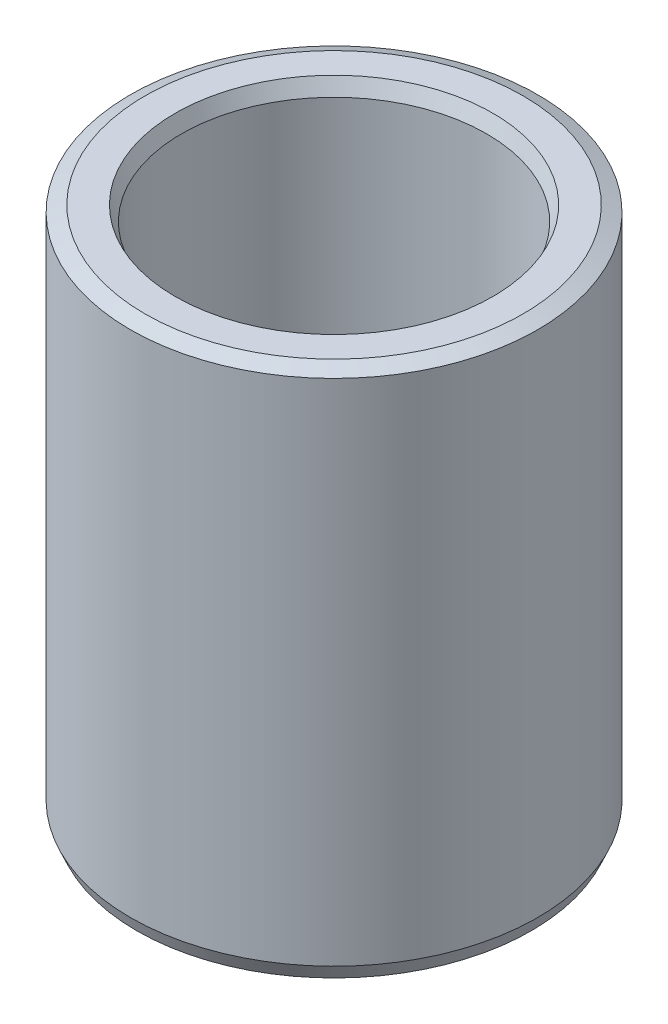
ISO-10303-21;
HEADER;
FILE_DESCRIPTION(('STEP AP214'),'2;1');
FILE_NAME('part.step','',(''),(''),'','','');
FILE_SCHEMA(('AUTOMOTIVE_DESIGN { 1 0 10303 214 1 1 1 1 }'));
ENDSEC;
DATA;
#1=APPLICATION_CONTEXT('core data for automotive mechanical design processes');
#2=APPLICATION_PROTOCOL_DEFINITION('international standard','automotive_design',2000,#1);
#3=PRODUCT_CONTEXT('',#1,'mechanical');
#4=PRODUCT('Part','Part','',(#3));
#5=PRODUCT_RELATED_PRODUCT_CATEGORY('part','',(#4));
#6=PRODUCT_DEFINITION_FORMATION('','',#4);
#7=PRODUCT_DEFINITION_CONTEXT('part definition',#1,'design');
#8=PRODUCT_DEFINITION('design','',#6,#7);
#9=PRODUCT_DEFINITION_SHAPE('','',#8);
#10=(LENGTH_UNIT() NAMED_UNIT(*) SI_UNIT(.MILLI.,.METRE.));
#11=(NAMED_UNIT(*) PLANE_ANGLE_UNIT() SI_UNIT($,.RADIAN.));
#12=(NAMED_UNIT(*) SI_UNIT($,.STERADIAN.) SOLID_ANGLE_UNIT());
#13=UNCERTAINTY_MEASURE_WITH_UNIT(LENGTH_MEASURE(1.E-05),#10,'distance_accuracy_value','');
#14=(GEOMETRIC_REPRESENTATION_CONTEXT(3) GLOBAL_UNCERTAINTY_ASSIGNED_CONTEXT((#13)) GLOBAL_UNIT_ASSIGNED_CONTEXT((#10,
#11,#12)) REPRESENTATION_CONTEXT('',''));
#15=CARTESIAN_POINT('',(0.,0.,0.));
#16=DIRECTION('',(0.,0.,1.));
#17=DIRECTION('',(1.,0.,0.));
#18=AXIS2_PLACEMENT_3D('',#15,#16,#17);
#19=CARTESIAN_POINT('',(0.,91.1093679499798,0.));
#20=DIRECTION('',(0.,-1.,0.));
#21=DIRECTION('',(0.,0.,-1.));
#22=AXIS2_PLACEMENT_3D('',#19,#20,#21);
#23=CYLINDRICAL_SURFACE('',#22,35.);
#24=CARTESIAN_POINT('',(0.,2.51631455846664,0.));
#25=DIRECTION('',(0.,1.,0.));
#26=DIRECTION('',(0.,0.,1.));
#27=AXIS2_PLACEMENT_3D('',#24,#25,#26);
#28=CIRCLE('',#27,35.);
#29=CARTESIAN_POINT('',(0.,2.51631455846664,35.));
#30=VERTEX_POINT('',#29);
#31=EDGE_CURVE('E10',#30,#30,#28,.T.);
#32=ORIENTED_EDGE('',*,*,#31,.T.);
#33=EDGE_LOOP('',(#32));
#34=FACE_BOUND('',#33,.T.);
#35=CARTESIAN_POINT('',(0.,90.0208981511356,0.));
#36=DIRECTION('',(0.,1.,0.));
#37=DIRECTION('',(0.,0.,1.));
#38=AXIS2_PLACEMENT_3D('',#35,#36,#37);
#39=CIRCLE('',#38,35.);
#40=CARTESIAN_POINT('',(0.,90.0208981511356,35.));
#41=VERTEX_POINT('',#40);
#42=EDGE_CURVE('E50',#41,#41,#39,.F.);
#43=ORIENTED_EDGE('',*,*,#42,.T.);
#44=EDGE_LOOP('',(#43));
#45=FACE_BOUND('',#44,.T.);
#46=ADVANCED_FACE('F39',(#34,#45),#23,.T.);
#47=CARTESIAN_POINT('',(0.,91.1093679499798,0.));
#48=DIRECTION('',(0.,1.,0.));
#49=DIRECTION('',(0.,0.,1.));
#50=AXIS2_PLACEMENT_3D('',#47,#48,#49);
#51=PLANE('',#50);
#52=CARTESIAN_POINT('',(0.,91.1093679499798,0.));
#53=DIRECTION('',(0.,1.,0.));
#54=DIRECTION('',(0.,0.,1.));
#55=AXIS2_PLACEMENT_3D('',#52,#53,#54);
#56=CIRCLE('',#55,27.3035944813365);
#57=CARTESIAN_POINT('',(0.,91.1093679499798,27.3035944813365));
#58=VERTEX_POINT('',#57);
#59=EDGE_CURVE('E58',#58,#58,#56,.F.);
#60=ORIENTED_EDGE('',*,*,#59,.T.);
#61=EDGE_LOOP('',(#60));
#62=FACE_BOUND('',#61,.T.);
#63=CARTESIAN_POINT('',(0.,91.1093679499798,0.));
#64=DIRECTION('',(0.,1.,0.));
#65=DIRECTION('',(0.,0.,1.));
#66=AXIS2_PLACEMENT_3D('',#63,#64,#65);
#67=CIRCLE('',#66,32.4836854415334);
#68=CARTESIAN_POINT('',(0.,91.1093679499798,32.4836854415334));
#69=VERTEX_POINT('',#68);
#70=EDGE_CURVE('E61',#69,#69,#67,.T.);
#71=ORIENTED_EDGE('',*,*,#70,.T.);
#72=EDGE_LOOP('',(#71));
#73=FACE_BOUND('',#72,.T.);
#74=ADVANCED_FACE('F88',(#62,#73),#51,.T.);
#75=CARTESIAN_POINT('',(0.,0.,0.));
#76=DIRECTION('',(0.,1.,0.));
#77=DIRECTION('',(0.,0.,1.));
#78=AXIS2_PLACEMENT_3D('',#75,#76,#77);
#79=PLANE('',#78);
#80=CARTESIAN_POINT('',(0.,0.,0.));
#81=DIRECTION('',(0.,1.,0.));
#82=DIRECTION('',(0.,0.,1.));
#83=AXIS2_PLACEMENT_3D('',#80,#81,#82);
#84=CIRCLE('',#83,28.7314392409589);
#85=CARTESIAN_POINT('',(0.,0.,28.7314392409589));
#86=VERTEX_POINT('',#85);
#87=EDGE_CURVE('E51',#86,#86,#84,.T.);
#88=ORIENTED_EDGE('',*,*,#87,.T.);
#89=EDGE_LOOP('',(#88));
#90=FACE_BOUND('',#89,.T.);
#91=CARTESIAN_POINT('',(0.,0.,0.));
#92=DIRECTION('',(0.,1.,0.));
#93=DIRECTION('',(0.,0.,1.));
#94=AXIS2_PLACEMENT_3D('',#91,#92,#93);
#95=CIRCLE('',#94,33.9115302011558);
#96=CARTESIAN_POINT('',(0.,0.,33.9115302011558));
#97=VERTEX_POINT('',#96);
#98=EDGE_CURVE('E54',#97,#97,#95,.F.);
#99=ORIENTED_EDGE('',*,*,#98,.T.);
#100=EDGE_LOOP('',(#99));
#101=FACE_BOUND('',#100,.T.);
#102=ADVANCED_FACE('F83',(#90,#101),#79,.F.);
#103=CARTESIAN_POINT('',(0.,91.1093679499798,0.));
#104=DIRECTION('',(0.,-1.,0.));
#105=DIRECTION('',(0.,0.,-1.));
#106=AXIS2_PLACEMENT_3D('',#103,#104,#105);
#107=CYLINDRICAL_SURFACE('',#106,26.2151246824923);
#108=CARTESIAN_POINT('',(0.,88.5930533915131,0.));
#109=DIRECTION('',(0.,1.,0.));
#110=DIRECTION('',(0.,0.,1.));
#111=AXIS2_PLACEMENT_3D('',#108,#109,#110);
#112=CIRCLE('',#111,26.2151246824923);
#113=CARTESIAN_POINT('',(0.,88.5930533915131,26.2151246824923));
#114=VERTEX_POINT('',#113);
#115=EDGE_CURVE('E67',#114,#114,#112,.T.);
#116=ORIENTED_EDGE('',*,*,#115,.T.);
#117=EDGE_LOOP('',(#116));
#118=FACE_BOUND('',#117,.T.);
#119=CARTESIAN_POINT('',(0.,1.08846979884418,0.));
#120=DIRECTION('',(0.,1.,0.));
#121=DIRECTION('',(0.,0.,1.));
#122=AXIS2_PLACEMENT_3D('',#119,#120,#121);
#123=CIRCLE('',#122,26.2151246824923);
#124=CARTESIAN_POINT('',(0.,1.08846979884418,26.2151246824923));
#125=VERTEX_POINT('',#124);
#126=EDGE_CURVE('E69',#125,#125,#123,.F.);
#127=ORIENTED_EDGE('',*,*,#126,.T.);
#128=EDGE_LOOP('',(#127));
#129=FACE_BOUND('',#128,.T.);
#130=ADVANCED_FACE('F71',(#118,#129),#107,.F.);
#131=CARTESIAN_POINT('',(0.,88.5930533915131,0.));
#132=DIRECTION('',(0.,1.,0.));
#133=DIRECTION('',(0.,0.,1.));
#134=AXIS2_PLACEMENT_3D('',#131,#132,#133);
#135=CONICAL_SURFACE('',#134,26.2151246824923,0.408260845666867);
#136=ORIENTED_EDGE('',*,*,#59,.F.);
#137=EDGE_LOOP('',(#136));
#138=FACE_BOUND('',#137,.T.);
#139=ORIENTED_EDGE('',*,*,#115,.F.);
#140=EDGE_LOOP('',(#139));
#141=FACE_BOUND('',#140,.T.);
#142=ADVANCED_FACE('F77',(#138,#141),#135,.F.);
#143=CARTESIAN_POINT('',(0.,0.,0.));
#144=DIRECTION('',(0.,-1.,0.));
#145=DIRECTION('',(0.,0.,-1.));
#146=AXIS2_PLACEMENT_3D('',#143,#144,#145);
#147=CONICAL_SURFACE('',#146,28.7314392409589,1.16253548112803);
#148=ORIENTED_EDGE('',*,*,#126,.F.);
#149=EDGE_LOOP('',(#148));
#150=FACE_BOUND('',#149,.T.);
#151=ORIENTED_EDGE('',*,*,#87,.F.);
#152=EDGE_LOOP('',(#151));
#153=FACE_BOUND('',#152,.T.);
#154=ADVANCED_FACE('F73',(#150,#153),#147,.F.);
#155=CARTESIAN_POINT('',(0.,2.51631455846664,0.));
#156=DIRECTION('',(0.,1.,0.));
#157=DIRECTION('',(0.,0.,1.));
#158=AXIS2_PLACEMENT_3D('',#155,#156,#157);
#159=CONICAL_SURFACE('',#158,35.,0.408260845666868);
#160=ORIENTED_EDGE('',*,*,#98,.F.);
#161=EDGE_LOOP('',(#160));
#162=FACE_BOUND('',#161,.T.);
#163=ORIENTED_EDGE('',*,*,#31,.F.);
#164=EDGE_LOOP('',(#163));
#165=FACE_BOUND('',#164,.T.);
#166=ADVANCED_FACE('F76',(#162,#165),#159,.T.);
#167=CARTESIAN_POINT('',(0.,91.1093679499798,0.));
#168=DIRECTION('',(0.,-1.,0.));
#169=DIRECTION('',(0.,0.,-1.));
#170=AXIS2_PLACEMENT_3D('',#167,#168,#169);
#171=CONICAL_SURFACE('',#170,32.4836854415334,1.16253548112803);
#172=ORIENTED_EDGE('',*,*,#42,.F.);
#173=EDGE_LOOP('',(#172));
#174=FACE_BOUND('',#173,.T.);
#175=ORIENTED_EDGE('',*,*,#70,.F.);
#176=EDGE_LOOP('',(#175));
#177=FACE_BOUND('',#176,.T.);
#178=ADVANCED_FACE('F45',(#174,#177),#171,.T.);
#179=CLOSED_SHELL('',(#46,#74,#102,#130,#142,#154,#166,#178));
#180=MANIFOLD_SOLID_BREP('B2',#179);
#181=ADVANCED_BREP_SHAPE_REPRESENTATION('',(#18,#180),#14);
#182=SHAPE_DEFINITION_REPRESENTATION(#9,#181);
ENDSEC;
END-ISO-10303-21;
